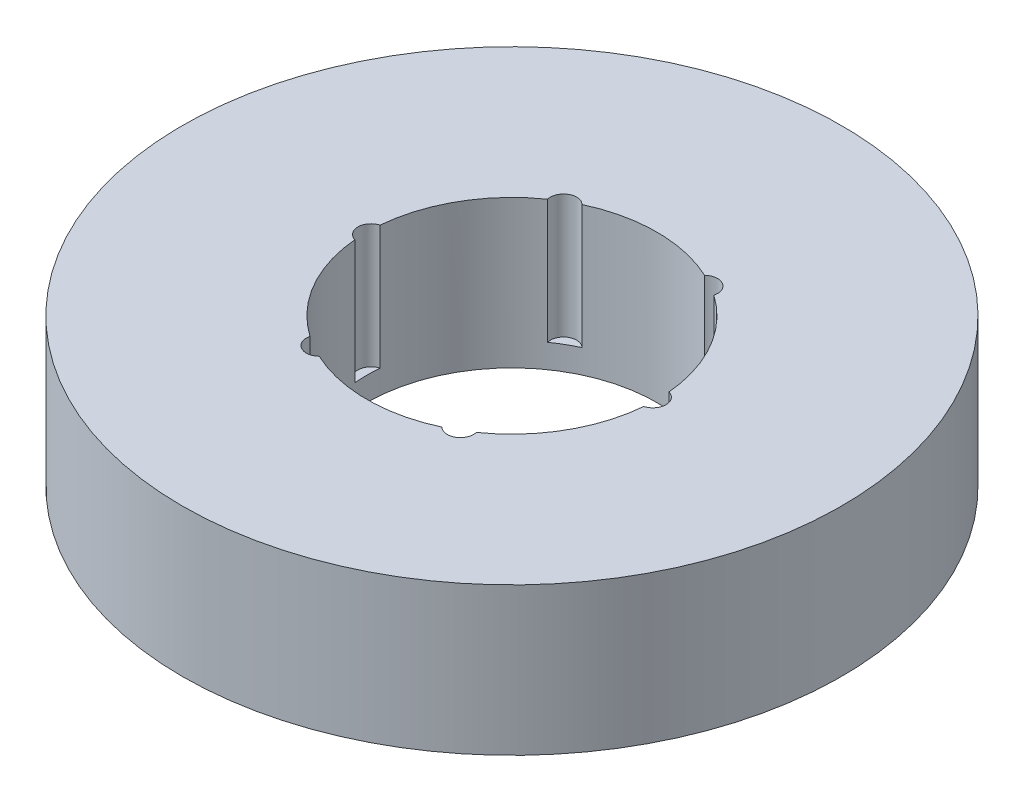
ISO-10303-21;
HEADER;
FILE_DESCRIPTION(('STEP AP214'),'2;1');
FILE_NAME('part.step','',(''),(''),'','','');
FILE_SCHEMA(('AUTOMOTIVE_DESIGN { 1 0 10303 214 1 1 1 1 }'));
ENDSEC;
DATA;
#1=APPLICATION_CONTEXT('core data for automotive mechanical design processes');
#2=APPLICATION_PROTOCOL_DEFINITION('international standard','automotive_design',2000,#1);
#3=PRODUCT_CONTEXT('',#1,'mechanical');
#4=PRODUCT('Part','Part','',(#3));
#5=PRODUCT_RELATED_PRODUCT_CATEGORY('part','',(#4));
#6=PRODUCT_DEFINITION_FORMATION('','',#4);
#7=PRODUCT_DEFINITION_CONTEXT('part definition',#1,'design');
#8=PRODUCT_DEFINITION('design','',#6,#7);
#9=PRODUCT_DEFINITION_SHAPE('','',#8);
#10=(LENGTH_UNIT() NAMED_UNIT(*) SI_UNIT(.MILLI.,.METRE.));
#11=(NAMED_UNIT(*) PLANE_ANGLE_UNIT() SI_UNIT($,.RADIAN.));
#12=(NAMED_UNIT(*) SI_UNIT($,.STERADIAN.) SOLID_ANGLE_UNIT());
#13=UNCERTAINTY_MEASURE_WITH_UNIT(LENGTH_MEASURE(1.E-05),#10,'distance_accuracy_value','');
#14=(GEOMETRIC_REPRESENTATION_CONTEXT(3) GLOBAL_UNCERTAINTY_ASSIGNED_CONTEXT((#13)) GLOBAL_UNIT_ASSIGNED_CONTEXT((#10,
#11,#12)) REPRESENTATION_CONTEXT('',''));
#15=CARTESIAN_POINT('',(0.,0.,0.));
#16=DIRECTION('',(0.,0.,1.));
#17=DIRECTION('',(1.,0.,0.));
#18=AXIS2_PLACEMENT_3D('',#15,#16,#17);
#19=CARTESIAN_POINT('',(0.,28.,0.));
#20=DIRECTION('',(0.,-1.,0.));
#21=DIRECTION('',(0.,0.,-1.));
#22=AXIS2_PLACEMENT_3D('',#19,#20,#21);
#23=CYLINDRICAL_SURFACE('',#22,62.5);
#24=CARTESIAN_POINT('',(0.,28.,0.));
#25=DIRECTION('',(0.,1.,0.));
#26=DIRECTION('',(0.,0.,1.));
#27=AXIS2_PLACEMENT_3D('',#24,#25,#26);
#28=CIRCLE('',#27,62.5);
#29=CARTESIAN_POINT('',(0.,28.,62.5));
#30=VERTEX_POINT('',#29);
#31=EDGE_CURVE('E162',#30,#30,#28,.T.);
#32=ORIENTED_EDGE('',*,*,#31,.F.);
#33=EDGE_LOOP('',(#32));
#34=FACE_BOUND('',#33,.T.);
#35=CARTESIAN_POINT('',(0.,0.,0.));
#36=DIRECTION('',(0.,1.,0.));
#37=DIRECTION('',(0.,0.,1.));
#38=AXIS2_PLACEMENT_3D('',#35,#36,#37);
#39=CIRCLE('',#38,62.5);
#40=CARTESIAN_POINT('',(0.,0.,62.5));
#41=VERTEX_POINT('',#40);
#42=EDGE_CURVE('E157',#41,#41,#39,.T.);
#43=ORIENTED_EDGE('',*,*,#42,.T.);
#44=EDGE_LOOP('',(#43));
#45=FACE_BOUND('',#44,.T.);
#46=ADVANCED_FACE('F39',(#34,#45),#23,.T.);
#47=CARTESIAN_POINT('',(0.,28.,0.));
#48=DIRECTION('',(0.,1.,0.));
#49=DIRECTION('',(0.,0.,1.));
#50=AXIS2_PLACEMENT_3D('',#47,#48,#49);
#51=PLANE('',#50);
#52=CARTESIAN_POINT('',(-13.3620603266663,28.,-23.1437673795857));
#53=DIRECTION('',(0.,1.,0.));
#54=DIRECTION('',(-0.866025403784433,0.,0.50000000000001));
#55=AXIS2_PLACEMENT_3D('',#52,#53,#54);
#56=CIRCLE('',#55,2.48455112876276);
#57=CARTESIAN_POINT('',(-11.6263115416397,28.,-24.9214542099119));
#58=VERTEX_POINT('',#57);
#59=CARTESIAN_POINT('',(-15.769456674215,28.,-22.5294082523278));
#60=VERTEX_POINT('',#59);
#61=EDGE_CURVE('E218',#58,#60,#56,.T.);
#62=ORIENTED_EDGE('',*,*,#61,.F.);
#63=CARTESIAN_POINT('',(0.,28.,0.));
#64=DIRECTION('',(0.,1.,0.));
#65=DIRECTION('',(0.,0.,1.));
#66=AXIS2_PLACEMENT_3D('',#63,#64,#65);
#67=CIRCLE('',#66,27.5);
#68=CARTESIAN_POINT('',(11.6263115416392,28.,-24.9214542099121));
#69=VERTEX_POINT('',#68);
#70=EDGE_CURVE('E169',#69,#58,#67,.T.);
#71=ORIENTED_EDGE('',*,*,#70,.F.);
#72=CARTESIAN_POINT('',(13.3620603266658,28.,-23.143767379586));
#73=DIRECTION('',(0.,1.,0.));
#74=DIRECTION('',(-0.866025403784443,0.,-0.499999999999992));
#75=AXIS2_PLACEMENT_3D('',#72,#73,#74);
#76=CIRCLE('',#75,2.48455112876276);
#77=CARTESIAN_POINT('',(15.7694566742146,28.,-22.5294082523281));
#78=VERTEX_POINT('',#77);
#79=EDGE_CURVE('E285',#78,#69,#76,.T.);
#80=ORIENTED_EDGE('',*,*,#79,.F.);
#81=CARTESIAN_POINT('',(27.3957682158542,28.,-2.39204595758408));
#82=VERTEX_POINT('',#81);
#83=EDGE_CURVE('E174',#82,#78,#67,.T.);
#84=ORIENTED_EDGE('',*,*,#83,.F.);
#85=CARTESIAN_POINT('',(26.724120653332,28.,0.));
#86=DIRECTION('',(0.,1.,0.));
#87=DIRECTION('',(0.,0.,-1.));
#88=AXIS2_PLACEMENT_3D('',#85,#86,#87);
#89=CIRCLE('',#88,2.48455112876276);
#90=CARTESIAN_POINT('',(27.3957682158542,28.,2.39204595758408));
#91=VERTEX_POINT('',#90);
#92=EDGE_CURVE('E280',#91,#82,#89,.T.);
#93=ORIENTED_EDGE('',*,*,#92,.F.);
#94=CARTESIAN_POINT('',(15.7694566742149,28.,22.5294082523279));
#95=VERTEX_POINT('',#94);
#96=EDGE_CURVE('E164',#95,#91,#67,.T.);
#97=ORIENTED_EDGE('',*,*,#96,.F.);
#98=CARTESIAN_POINT('',(13.3620603266661,28.,23.1437673795858));
#99=DIRECTION('',(0.,1.,0.));
#100=DIRECTION('',(0.866025403784436,0.,-0.500000000000004));
#101=AXIS2_PLACEMENT_3D('',#98,#99,#100);
#102=CIRCLE('',#101,2.48455112876276);
#103=CARTESIAN_POINT('',(11.6263115416395,28.,24.921454209912));
#104=VERTEX_POINT('',#103);
#105=EDGE_CURVE('E269',#104,#95,#102,.T.);
#106=ORIENTED_EDGE('',*,*,#105,.F.);
#107=CARTESIAN_POINT('',(-11.6263115416393,28.,24.9214542099121));
#108=VERTEX_POINT('',#107);
#109=EDGE_CURVE('E149',#108,#104,#67,.T.);
#110=ORIENTED_EDGE('',*,*,#109,.F.);
#111=CARTESIAN_POINT('',(-13.3620603266659,28.,23.1437673795859));
#112=DIRECTION('',(0.,1.,0.));
#113=DIRECTION('',(0.86602540378444,0.,0.499999999999998));
#114=AXIS2_PLACEMENT_3D('',#111,#112,#113);
#115=CIRCLE('',#114,2.48455112876276);
#116=CARTESIAN_POINT('',(-15.7694566742147,28.,22.529408252328));
#117=VERTEX_POINT('',#116);
#118=EDGE_CURVE('E128',#117,#108,#115,.T.);
#119=ORIENTED_EDGE('',*,*,#118,.F.);
#120=CARTESIAN_POINT('',(-27.3957682158542,28.,2.39204595758408));
#121=VERTEX_POINT('',#120);
#122=EDGE_CURVE('E148',#121,#117,#67,.T.);
#123=ORIENTED_EDGE('',*,*,#122,.F.);
#124=CARTESIAN_POINT('',(-26.724120653332,28.,0.));
#125=DIRECTION('',(0.,1.,0.));
#126=DIRECTION('',(0.,0.,1.));
#127=AXIS2_PLACEMENT_3D('',#124,#125,#126);
#128=CIRCLE('',#127,2.48455112876276);
#129=CARTESIAN_POINT('',(-27.3957682158542,28.,-2.39204595758408));
#130=VERTEX_POINT('',#129);
#131=EDGE_CURVE('E179',#130,#121,#128,.T.);
#132=ORIENTED_EDGE('',*,*,#131,.F.);
#133=EDGE_CURVE('E161',#60,#130,#67,.T.);
#134=ORIENTED_EDGE('',*,*,#133,.F.);
#135=EDGE_LOOP('',(#62,#71,#80,#84,#93,#97,#106,#110,#119,#123,#132,#134));
#136=FACE_BOUND('',#135,.T.);
#137=ORIENTED_EDGE('',*,*,#31,.T.);
#138=EDGE_LOOP('',(#137));
#139=FACE_BOUND('',#138,.T.);
#140=ADVANCED_FACE('F141',(#136,#139),#51,.T.);
#141=CARTESIAN_POINT('',(0.,0.,0.));
#142=DIRECTION('',(0.,1.,0.));
#143=DIRECTION('',(0.,0.,1.));
#144=AXIS2_PLACEMENT_3D('',#141,#142,#143);
#145=PLANE('',#144);
#146=CARTESIAN_POINT('',(0.,0.,0.));
#147=DIRECTION('',(0.,1.,0.));
#148=DIRECTION('',(0.,0.,1.));
#149=AXIS2_PLACEMENT_3D('',#146,#147,#148);
#150=CIRCLE('',#149,27.5);
#151=CARTESIAN_POINT('',(0.,0.,27.5));
#152=VERTEX_POINT('',#151);
#153=EDGE_CURVE('E166',#152,#152,#150,.T.);
#154=ORIENTED_EDGE('',*,*,#153,.T.);
#155=EDGE_LOOP('',(#154));
#156=FACE_BOUND('',#155,.T.);
#157=ORIENTED_EDGE('',*,*,#42,.F.);
#158=EDGE_LOOP('',(#157));
#159=FACE_BOUND('',#158,.T.);
#160=ADVANCED_FACE('F234',(#156,#159),#145,.F.);
#161=CARTESIAN_POINT('',(0.,28.,0.));
#162=DIRECTION('',(0.,-1.,0.));
#163=DIRECTION('',(0.,0.,-1.));
#164=AXIS2_PLACEMENT_3D('',#161,#162,#163);
#165=CYLINDRICAL_SURFACE('',#164,27.5);
#166=DIRECTION('',(0.,1.,0.));
#167=VECTOR('',#166,1.);
#168=CARTESIAN_POINT('',(-11.6263115416397,16.2520516648162,-24.9214542099119));
#169=LINE('',#168,#167);
#170=CARTESIAN_POINT('',(-11.6263115416397,4.50410332963236,-24.9214542099119));
#171=VERTEX_POINT('',#170);
#172=EDGE_CURVE('E11',#171,#58,#169,.T.);
#173=ORIENTED_EDGE('',*,*,#172,.F.);
#174=CARTESIAN_POINT('',(0.,4.50410332963236,0.));
#175=DIRECTION('',(0.,1.,0.));
#176=DIRECTION('',(0.,0.,1.));
#177=AXIS2_PLACEMENT_3D('',#174,#175,#176);
#178=CIRCLE('',#177,27.5);
#179=CARTESIAN_POINT('',(-15.769456674215,4.50410332963236,-22.5294082523278));
#180=VERTEX_POINT('',#179);
#181=EDGE_CURVE('E214',#171,#180,#178,.T.);
#182=ORIENTED_EDGE('',*,*,#181,.T.);
#183=DIRECTION('',(0.,1.,0.));
#184=VECTOR('',#183,1.);
#185=CARTESIAN_POINT('',(-15.769456674215,16.2520516648162,-22.5294082523278));
#186=LINE('',#185,#184);
#187=EDGE_CURVE('E46',#60,#180,#186,.F.);
#188=ORIENTED_EDGE('',*,*,#187,.F.);
#189=ORIENTED_EDGE('',*,*,#133,.T.);
#190=DIRECTION('',(0.,1.,0.));
#191=VECTOR('',#190,1.);
#192=CARTESIAN_POINT('',(-27.3957682158542,16.2520516648162,-2.39204595758408));
#193=LINE('',#192,#191);
#194=CARTESIAN_POINT('',(-27.3957682158542,4.50410332963236,-2.39204595758408));
#195=VERTEX_POINT('',#194);
#196=EDGE_CURVE('E187',#195,#130,#193,.T.);
#197=ORIENTED_EDGE('',*,*,#196,.F.);
#198=CARTESIAN_POINT('',(0.,4.50410332963236,0.));
#199=DIRECTION('',(0.,1.,0.));
#200=DIRECTION('',(0.,0.,1.));
#201=AXIS2_PLACEMENT_3D('',#198,#199,#200);
#202=CIRCLE('',#201,27.5);
#203=CARTESIAN_POINT('',(-27.3957682158542,4.50410332963236,2.39204595758408));
#204=VERTEX_POINT('',#203);
#205=EDGE_CURVE('E184',#195,#204,#202,.T.);
#206=ORIENTED_EDGE('',*,*,#205,.T.);
#207=DIRECTION('',(0.,1.,0.));
#208=VECTOR('',#207,1.);
#209=CARTESIAN_POINT('',(-27.3957682158542,16.2520516648162,2.39204595758408));
#210=LINE('',#209,#208);
#211=EDGE_CURVE('E158',#121,#204,#210,.F.);
#212=ORIENTED_EDGE('',*,*,#211,.F.);
#213=ORIENTED_EDGE('',*,*,#122,.T.);
#214=DIRECTION('',(0.,1.,0.));
#215=VECTOR('',#214,1.);
#216=CARTESIAN_POINT('',(-15.7694566742147,16.2520516648162,22.529408252328));
#217=LINE('',#216,#215);
#218=CARTESIAN_POINT('',(-15.7694566742147,4.50410332963236,22.529408252328));
#219=VERTEX_POINT('',#218);
#220=EDGE_CURVE('E127',#219,#117,#217,.T.);
#221=ORIENTED_EDGE('',*,*,#220,.F.);
#222=CARTESIAN_POINT('',(0.,4.50410332963236,0.));
#223=DIRECTION('',(0.,1.,0.));
#224=DIRECTION('',(0.,0.,1.));
#225=AXIS2_PLACEMENT_3D('',#222,#223,#224);
#226=CIRCLE('',#225,27.5);
#227=CARTESIAN_POINT('',(-11.6263115416393,4.50410332963236,24.9214542099121));
#228=VERTEX_POINT('',#227);
#229=EDGE_CURVE('E189',#219,#228,#226,.T.);
#230=ORIENTED_EDGE('',*,*,#229,.T.);
#231=DIRECTION('',(0.,1.,0.));
#232=VECTOR('',#231,1.);
#233=CARTESIAN_POINT('',(-11.6263115416393,16.2520516648162,24.9214542099121));
#234=LINE('',#233,#232);
#235=EDGE_CURVE('E140',#108,#228,#234,.F.);
#236=ORIENTED_EDGE('',*,*,#235,.F.);
#237=ORIENTED_EDGE('',*,*,#109,.T.);
#238=DIRECTION('',(0.,1.,0.));
#239=VECTOR('',#238,1.);
#240=CARTESIAN_POINT('',(11.6263115416395,16.2520516648162,24.921454209912));
#241=LINE('',#240,#239);
#242=CARTESIAN_POINT('',(11.6263115416395,4.50410332963236,24.921454209912));
#243=VERTEX_POINT('',#242);
#244=EDGE_CURVE('E196',#243,#104,#241,.T.);
#245=ORIENTED_EDGE('',*,*,#244,.F.);
#246=CARTESIAN_POINT('',(0.,4.50410332963236,0.));
#247=DIRECTION('',(0.,1.,0.));
#248=DIRECTION('',(0.,0.,1.));
#249=AXIS2_PLACEMENT_3D('',#246,#247,#248);
#250=CIRCLE('',#249,27.5);
#251=CARTESIAN_POINT('',(15.7694566742149,4.50410332963236,22.5294082523279));
#252=VERTEX_POINT('',#251);
#253=EDGE_CURVE('E136',#243,#252,#250,.T.);
#254=ORIENTED_EDGE('',*,*,#253,.T.);
#255=DIRECTION('',(0.,1.,0.));
#256=VECTOR('',#255,1.);
#257=CARTESIAN_POINT('',(15.7694566742149,16.2520516648162,22.5294082523279));
#258=LINE('',#257,#256);
#259=EDGE_CURVE('E194',#95,#252,#258,.F.);
#260=ORIENTED_EDGE('',*,*,#259,.F.);
#261=ORIENTED_EDGE('',*,*,#96,.T.);
#262=DIRECTION('',(0.,1.,0.));
#263=VECTOR('',#262,1.);
#264=CARTESIAN_POINT('',(27.3957682158542,16.2520516648162,2.39204595758408));
#265=LINE('',#264,#263);
#266=CARTESIAN_POINT('',(27.3957682158542,4.50410332963236,2.39204595758408));
#267=VERTEX_POINT('',#266);
#268=EDGE_CURVE('E206',#267,#91,#265,.T.);
#269=ORIENTED_EDGE('',*,*,#268,.F.);
#270=CARTESIAN_POINT('',(0.,4.50410332963236,0.));
#271=DIRECTION('',(0.,1.,0.));
#272=DIRECTION('',(0.,0.,1.));
#273=AXIS2_PLACEMENT_3D('',#270,#271,#272);
#274=CIRCLE('',#273,27.5);
#275=CARTESIAN_POINT('',(27.3957682158542,4.50410332963236,-2.39204595758408));
#276=VERTEX_POINT('',#275);
#277=EDGE_CURVE('E199',#267,#276,#274,.T.);
#278=ORIENTED_EDGE('',*,*,#277,.T.);
#279=DIRECTION('',(0.,1.,0.));
#280=VECTOR('',#279,1.);
#281=CARTESIAN_POINT('',(27.3957682158542,16.2520516648162,-2.39204595758408));
#282=LINE('',#281,#280);
#283=EDGE_CURVE('E201',#82,#276,#282,.F.);
#284=ORIENTED_EDGE('',*,*,#283,.F.);
#285=ORIENTED_EDGE('',*,*,#83,.T.);
#286=DIRECTION('',(0.,1.,0.));
#287=VECTOR('',#286,1.);
#288=CARTESIAN_POINT('',(15.7694566742146,16.2520516648162,-22.5294082523281));
#289=LINE('',#288,#287);
#290=CARTESIAN_POINT('',(15.7694566742146,4.50410332963236,-22.5294082523281));
#291=VERTEX_POINT('',#290);
#292=EDGE_CURVE('E213',#291,#78,#289,.T.);
#293=ORIENTED_EDGE('',*,*,#292,.F.);
#294=CARTESIAN_POINT('',(0.,4.50410332963236,0.));
#295=DIRECTION('',(0.,1.,0.));
#296=DIRECTION('',(0.,0.,1.));
#297=AXIS2_PLACEMENT_3D('',#294,#295,#296);
#298=CIRCLE('',#297,27.5);
#299=CARTESIAN_POINT('',(11.6263115416392,4.50410332963236,-24.9214542099121));
#300=VERTEX_POINT('',#299);
#301=EDGE_CURVE('E208',#291,#300,#298,.T.);
#302=ORIENTED_EDGE('',*,*,#301,.T.);
#303=DIRECTION('',(0.,1.,0.));
#304=VECTOR('',#303,1.);
#305=CARTESIAN_POINT('',(11.6263115416392,16.2520516648162,-24.9214542099121));
#306=LINE('',#305,#304);
#307=EDGE_CURVE('E211',#69,#300,#306,.F.);
#308=ORIENTED_EDGE('',*,*,#307,.F.);
#309=ORIENTED_EDGE('',*,*,#70,.T.);
#310=EDGE_LOOP('',(#173,#182,#188,#189,#197,#206,#212,#213,#221,#230,#236,#237,#245,#254,#260,
#261,#269,#278,#284,#285,#293,#302,#308,#309));
#311=FACE_BOUND('',#310,.T.);
#312=ORIENTED_EDGE('',*,*,#153,.F.);
#313=EDGE_LOOP('',(#312));
#314=FACE_BOUND('',#313,.T.);
#315=ADVANCED_FACE('F152',(#311,#314),#165,.F.);
#316=CARTESIAN_POINT('',(-26.724120653332,4.50410332963236,0.));
#317=DIRECTION('',(0.,1.,0.));
#318=DIRECTION('',(0.,0.,1.));
#319=AXIS2_PLACEMENT_3D('',#316,#317,#318);
#320=CYLINDRICAL_SURFACE('',#319,2.48455112876276);
#321=ORIENTED_EDGE('',*,*,#196,.T.);
#322=ORIENTED_EDGE('',*,*,#131,.T.);
#323=ORIENTED_EDGE('',*,*,#211,.T.);
#324=CARTESIAN_POINT('',(-26.724120653332,4.50410332963236,0.));
#325=DIRECTION('',(0.,1.,0.));
#326=DIRECTION('',(0.,0.,1.));
#327=AXIS2_PLACEMENT_3D('',#324,#325,#326);
#328=CIRCLE('',#327,2.48455112876276);
#329=EDGE_CURVE('E180',#195,#204,#328,.T.);
#330=ORIENTED_EDGE('',*,*,#329,.F.);
#331=EDGE_LOOP('',(#321,#322,#323,#330));
#332=FACE_BOUND('',#331,.T.);
#333=ADVANCED_FACE('F244',(#332),#320,.F.);
#334=CARTESIAN_POINT('',(-26.724120653332,4.50410332963236,0.));
#335=DIRECTION('',(0.,1.,0.));
#336=DIRECTION('',(0.,0.,1.));
#337=AXIS2_PLACEMENT_3D('',#334,#335,#336);
#338=PLANE('',#337);
#339=ORIENTED_EDGE('',*,*,#329,.T.);
#340=ORIENTED_EDGE('',*,*,#205,.F.);
#341=EDGE_LOOP('',(#339,#340));
#342=FACE_BOUND('',#341,.T.);
#343=ADVANCED_FACE('F248',(#342),#338,.T.);
#344=CARTESIAN_POINT('',(-13.3620603266659,4.50410332963236,23.1437673795859));
#345=DIRECTION('',(0.,1.,0.));
#346=DIRECTION('',(0.,0.,1.));
#347=AXIS2_PLACEMENT_3D('',#344,#345,#346);
#348=CYLINDRICAL_SURFACE('',#347,2.48455112876276);
#349=ORIENTED_EDGE('',*,*,#220,.T.);
#350=ORIENTED_EDGE('',*,*,#118,.T.);
#351=ORIENTED_EDGE('',*,*,#235,.T.);
#352=CARTESIAN_POINT('',(-13.3620603266659,4.50410332963236,23.1437673795859));
#353=DIRECTION('',(0.,1.,0.));
#354=DIRECTION('',(0.86602540378444,0.,0.499999999999998));
#355=AXIS2_PLACEMENT_3D('',#352,#353,#354);
#356=CIRCLE('',#355,2.48455112876276);
#357=EDGE_CURVE('E135',#219,#228,#356,.T.);
#358=ORIENTED_EDGE('',*,*,#357,.F.);
#359=EDGE_LOOP('',(#349,#350,#351,#358));
#360=FACE_BOUND('',#359,.T.);
#361=ADVANCED_FACE('F126',(#360),#348,.F.);
#362=CARTESIAN_POINT('',(-13.3620603266659,4.50410332963236,23.1437673795859));
#363=DIRECTION('',(0.,1.,0.));
#364=DIRECTION('',(0.86602540378444,0.,0.499999999999998));
#365=AXIS2_PLACEMENT_3D('',#362,#363,#364);
#366=PLANE('',#365);
#367=ORIENTED_EDGE('',*,*,#357,.T.);
#368=ORIENTED_EDGE('',*,*,#229,.F.);
#369=EDGE_LOOP('',(#367,#368));
#370=FACE_BOUND('',#369,.T.);
#371=ADVANCED_FACE('F258',(#370),#366,.T.);
#372=CARTESIAN_POINT('',(13.3620603266661,4.50410332963236,23.1437673795858));
#373=DIRECTION('',(0.,1.,0.));
#374=DIRECTION('',(0.,0.,1.));
#375=AXIS2_PLACEMENT_3D('',#372,#373,#374);
#376=CYLINDRICAL_SURFACE('',#375,2.48455112876276);
#377=ORIENTED_EDGE('',*,*,#244,.T.);
#378=ORIENTED_EDGE('',*,*,#105,.T.);
#379=ORIENTED_EDGE('',*,*,#259,.T.);
#380=CARTESIAN_POINT('',(13.3620603266661,4.50410332963236,23.1437673795858));
#381=DIRECTION('',(0.,1.,0.));
#382=DIRECTION('',(0.866025403784436,0.,-0.500000000000004));
#383=AXIS2_PLACEMENT_3D('',#380,#381,#382);
#384=CIRCLE('',#383,2.48455112876276);
#385=EDGE_CURVE('E147',#243,#252,#384,.T.);
#386=ORIENTED_EDGE('',*,*,#385,.F.);
#387=EDGE_LOOP('',(#377,#378,#379,#386));
#388=FACE_BOUND('',#387,.T.);
#389=ADVANCED_FACE('F256',(#388),#376,.F.);
#390=CARTESIAN_POINT('',(13.3620603266661,4.50410332963236,23.1437673795858));
#391=DIRECTION('',(0.,1.,0.));
#392=DIRECTION('',(0.866025403784436,0.,-0.500000000000004));
#393=AXIS2_PLACEMENT_3D('',#390,#391,#392);
#394=PLANE('',#393);
#395=ORIENTED_EDGE('',*,*,#385,.T.);
#396=ORIENTED_EDGE('',*,*,#253,.F.);
#397=EDGE_LOOP('',(#395,#396));
#398=FACE_BOUND('',#397,.T.);
#399=ADVANCED_FACE('F263',(#398),#394,.T.);
#400=CARTESIAN_POINT('',(26.724120653332,4.50410332963236,0.));
#401=DIRECTION('',(0.,1.,0.));
#402=DIRECTION('',(0.,0.,1.));
#403=AXIS2_PLACEMENT_3D('',#400,#401,#402);
#404=CYLINDRICAL_SURFACE('',#403,2.48455112876276);
#405=ORIENTED_EDGE('',*,*,#268,.T.);
#406=ORIENTED_EDGE('',*,*,#92,.T.);
#407=ORIENTED_EDGE('',*,*,#283,.T.);
#408=CARTESIAN_POINT('',(26.724120653332,4.50410332963236,0.));
#409=DIRECTION('',(0.,1.,0.));
#410=DIRECTION('',(0.,0.,-1.));
#411=AXIS2_PLACEMENT_3D('',#408,#409,#410);
#412=CIRCLE('',#411,2.48455112876276);
#413=EDGE_CURVE('E273',#267,#276,#412,.T.);
#414=ORIENTED_EDGE('',*,*,#413,.F.);
#415=EDGE_LOOP('',(#405,#406,#407,#414));
#416=FACE_BOUND('',#415,.T.);
#417=ADVANCED_FACE('F297',(#416),#404,.F.);
#418=CARTESIAN_POINT('',(26.724120653332,4.50410332963236,0.));
#419=DIRECTION('',(0.,1.,0.));
#420=DIRECTION('',(0.,0.,-1.));
#421=AXIS2_PLACEMENT_3D('',#418,#419,#420);
#422=PLANE('',#421);
#423=ORIENTED_EDGE('',*,*,#413,.T.);
#424=ORIENTED_EDGE('',*,*,#277,.F.);
#425=EDGE_LOOP('',(#423,#424));
#426=FACE_BOUND('',#425,.T.);
#427=ADVANCED_FACE('F299',(#426),#422,.T.);
#428=CARTESIAN_POINT('',(13.3620603266658,4.50410332963236,-23.143767379586));
#429=DIRECTION('',(0.,1.,0.));
#430=DIRECTION('',(0.,0.,1.));
#431=AXIS2_PLACEMENT_3D('',#428,#429,#430);
#432=CYLINDRICAL_SURFACE('',#431,2.48455112876276);
#433=ORIENTED_EDGE('',*,*,#292,.T.);
#434=ORIENTED_EDGE('',*,*,#79,.T.);
#435=ORIENTED_EDGE('',*,*,#307,.T.);
#436=CARTESIAN_POINT('',(13.3620603266658,4.50410332963236,-23.143767379586));
#437=DIRECTION('',(0.,1.,0.));
#438=DIRECTION('',(-0.866025403784443,0.,-0.499999999999992));
#439=AXIS2_PLACEMENT_3D('',#436,#437,#438);
#440=CIRCLE('',#439,2.48455112876276);
#441=EDGE_CURVE('E56',#291,#300,#440,.T.);
#442=ORIENTED_EDGE('',*,*,#441,.F.);
#443=EDGE_LOOP('',(#433,#434,#435,#442));
#444=FACE_BOUND('',#443,.T.);
#445=ADVANCED_FACE('F292',(#444),#432,.F.);
#446=CARTESIAN_POINT('',(13.3620603266658,4.50410332963236,-23.143767379586));
#447=DIRECTION('',(0.,1.,0.));
#448=DIRECTION('',(-0.866025403784443,0.,-0.499999999999992));
#449=AXIS2_PLACEMENT_3D('',#446,#447,#448);
#450=PLANE('',#449);
#451=ORIENTED_EDGE('',*,*,#441,.T.);
#452=ORIENTED_EDGE('',*,*,#301,.F.);
#453=EDGE_LOOP('',(#451,#452));
#454=FACE_BOUND('',#453,.T.);
#455=ADVANCED_FACE('F226',(#454),#450,.T.);
#456=CARTESIAN_POINT('',(-13.3620603266663,4.50410332963236,-23.1437673795857));
#457=DIRECTION('',(0.,1.,0.));
#458=DIRECTION('',(0.,0.,1.));
#459=AXIS2_PLACEMENT_3D('',#456,#457,#458);
#460=CYLINDRICAL_SURFACE('',#459,2.48455112876276);
#461=ORIENTED_EDGE('',*,*,#172,.T.);
#462=ORIENTED_EDGE('',*,*,#61,.T.);
#463=ORIENTED_EDGE('',*,*,#187,.T.);
#464=CARTESIAN_POINT('',(-13.3620603266663,4.50410332963236,-23.1437673795857));
#465=DIRECTION('',(0.,1.,0.));
#466=DIRECTION('',(-0.866025403784433,0.,0.50000000000001));
#467=AXIS2_PLACEMENT_3D('',#464,#465,#466);
#468=CIRCLE('',#467,2.48455112876276);
#469=EDGE_CURVE('E55',#171,#180,#468,.T.);
#470=ORIENTED_EDGE('',*,*,#469,.F.);
#471=EDGE_LOOP('',(#461,#462,#463,#470));
#472=FACE_BOUND('',#471,.T.);
#473=ADVANCED_FACE('F217',(#472),#460,.F.);
#474=CARTESIAN_POINT('',(-13.3620603266663,4.50410332963236,-23.1437673795857));
#475=DIRECTION('',(0.,1.,0.));
#476=DIRECTION('',(-0.866025403784433,0.,0.50000000000001));
#477=AXIS2_PLACEMENT_3D('',#474,#475,#476);
#478=PLANE('',#477);
#479=ORIENTED_EDGE('',*,*,#469,.T.);
#480=ORIENTED_EDGE('',*,*,#181,.F.);
#481=EDGE_LOOP('',(#479,#480));
#482=FACE_BOUND('',#481,.T.);
#483=ADVANCED_FACE('F219',(#482),#478,.T.);
#484=CLOSED_SHELL('',(#46,#140,#160,#315,#333,#343,#361,#371,#389,#399,#417,#427,#445,#455,#473,#483));
#485=MANIFOLD_SOLID_BREP('B2',#484);
#486=ADVANCED_BREP_SHAPE_REPRESENTATION('',(#18,#485),#14);
#487=SHAPE_DEFINITION_REPRESENTATION(#9,#486);
ENDSEC;
END-ISO-10303-21;
